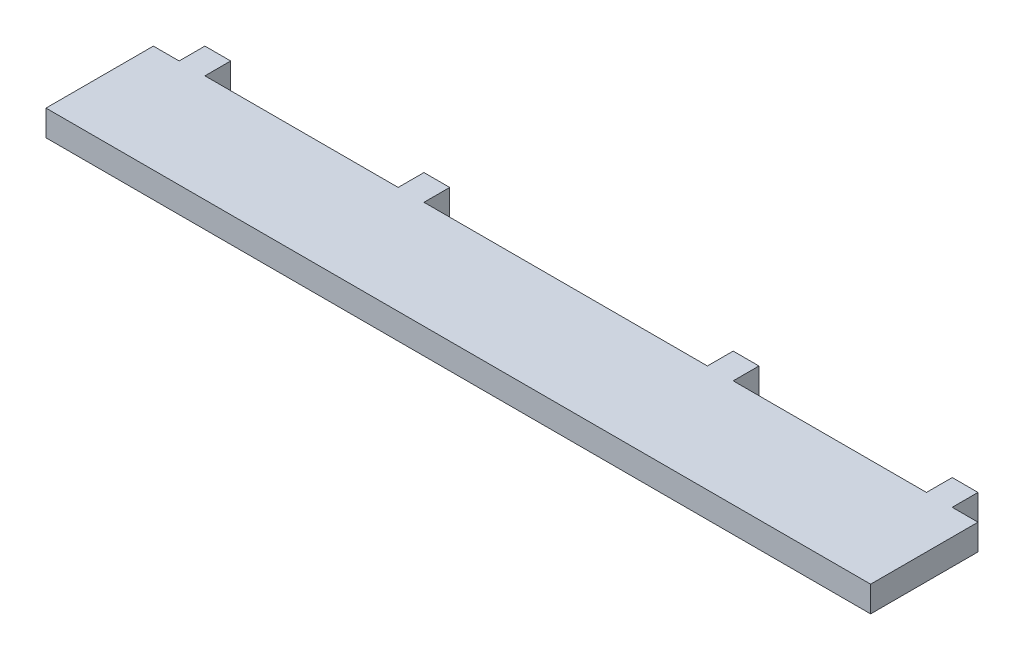
ISO-10303-21;
HEADER;
FILE_DESCRIPTION(('STEP AP214'),'2;1');
FILE_NAME('part.step','',(''),(''),'','','');
FILE_SCHEMA(('AUTOMOTIVE_DESIGN { 1 0 10303 214 1 1 1 1 }'));
ENDSEC;
DATA;
#1=APPLICATION_CONTEXT('core data for automotive mechanical design processes');
#2=APPLICATION_PROTOCOL_DEFINITION('international standard','automotive_design',2000,#1);
#3=PRODUCT_CONTEXT('',#1,'mechanical');
#4=PRODUCT('Part','Part','',(#3));
#5=PRODUCT_RELATED_PRODUCT_CATEGORY('part','',(#4));
#6=PRODUCT_DEFINITION_FORMATION('','',#4);
#7=PRODUCT_DEFINITION_CONTEXT('part definition',#1,'design');
#8=PRODUCT_DEFINITION('design','',#6,#7);
#9=PRODUCT_DEFINITION_SHAPE('','',#8);
#10=(LENGTH_UNIT() NAMED_UNIT(*) SI_UNIT(.MILLI.,.METRE.));
#11=(NAMED_UNIT(*) PLANE_ANGLE_UNIT() SI_UNIT($,.RADIAN.));
#12=(NAMED_UNIT(*) SI_UNIT($,.STERADIAN.) SOLID_ANGLE_UNIT());
#13=UNCERTAINTY_MEASURE_WITH_UNIT(LENGTH_MEASURE(1.E-05),#10,'distance_accuracy_value','');
#14=(GEOMETRIC_REPRESENTATION_CONTEXT(3) GLOBAL_UNCERTAINTY_ASSIGNED_CONTEXT((#13)) GLOBAL_UNIT_ASSIGNED_CONTEXT((#10,
#11,#12)) REPRESENTATION_CONTEXT('',''));
#15=CARTESIAN_POINT('',(0.,0.,0.));
#16=DIRECTION('',(0.,0.,1.));
#17=DIRECTION('',(1.,0.,0.));
#18=AXIS2_PLACEMENT_3D('',#15,#16,#17);
#19=CARTESIAN_POINT('',(0.,0.,0.));
#20=DIRECTION('',(0.,0.,-1.));
#21=DIRECTION('',(-1.,0.,0.));
#22=AXIS2_PLACEMENT_3D('',#19,#20,#21);
#23=PLANE('',#22);
#24=DIRECTION('',(-1.,0.,0.));
#25=VECTOR('',#24,1.);
#26=CARTESIAN_POINT('',(-96.,5.99999999999999,0.));
#27=LINE('',#26,#25);
#28=CARTESIAN_POINT('',(84.,6.,0.));
#29=VERTEX_POINT('',#28);
#30=CARTESIAN_POINT('',(39.,6.,0.));
#31=VERTEX_POINT('',#30);
#32=EDGE_CURVE('E177',#29,#31,#27,.T.);
#33=ORIENTED_EDGE('',*,*,#32,.F.);
#34=DIRECTION('',(0.,-1.,0.));
#35=VECTOR('',#34,1.);
#36=CARTESIAN_POINT('',(84.,6.,0.));
#37=LINE('',#36,#35);
#38=CARTESIAN_POINT('',(84.,0.,0.));
#39=VERTEX_POINT('',#38);
#40=EDGE_CURVE('E188',#29,#39,#37,.T.);
#41=ORIENTED_EDGE('',*,*,#40,.T.);
#42=DIRECTION('',(1.,0.,0.));
#43=VECTOR('',#42,1.);
#44=CARTESIAN_POINT('',(96.,0.,0.));
#45=LINE('',#44,#43);
#46=CARTESIAN_POINT('',(39.,0.,0.));
#47=VERTEX_POINT('',#46);
#48=EDGE_CURVE('E331',#47,#39,#45,.T.);
#49=ORIENTED_EDGE('',*,*,#48,.F.);
#50=DIRECTION('',(0.,-1.,0.));
#51=VECTOR('',#50,1.);
#52=CARTESIAN_POINT('',(39.,6.,0.));
#53=LINE('',#52,#51);
#54=EDGE_CURVE('E198',#31,#47,#53,.T.);
#55=ORIENTED_EDGE('',*,*,#54,.F.);
#56=EDGE_LOOP('',(#33,#41,#49,#55));
#57=FACE_BOUND('',#56,.T.);
#58=ADVANCED_FACE('F36',(#57),#23,.T.);
#59=CARTESIAN_POINT('',(90.,0.,0.));
#60=VERTEX_POINT('',#59);
#61=CARTESIAN_POINT('',(96.,0.,0.));
#62=VERTEX_POINT('',#61);
#63=EDGE_CURVE('E210',#60,#62,#45,.T.);
#64=ORIENTED_EDGE('',*,*,#63,.F.);
#65=DIRECTION('',(0.,-1.,0.));
#66=VECTOR('',#65,1.);
#67=CARTESIAN_POINT('',(90.,6.,0.));
#68=LINE('',#67,#66);
#69=CARTESIAN_POINT('',(90.,6.,0.));
#70=VERTEX_POINT('',#69);
#71=EDGE_CURVE('E195',#70,#60,#68,.T.);
#72=ORIENTED_EDGE('',*,*,#71,.F.);
#73=CARTESIAN_POINT('',(96.,5.99999999999999,0.));
#74=VERTEX_POINT('',#73);
#75=EDGE_CURVE('E199',#74,#70,#27,.T.);
#76=ORIENTED_EDGE('',*,*,#75,.F.);
#77=DIRECTION('',(0.,1.,0.));
#78=VECTOR('',#77,1.);
#79=CARTESIAN_POINT('',(96.,0.,0.));
#80=LINE('',#79,#78);
#81=EDGE_CURVE('E207',#62,#74,#80,.T.);
#82=ORIENTED_EDGE('',*,*,#81,.F.);
#83=EDGE_LOOP('',(#64,#72,#76,#82));
#84=FACE_BOUND('',#83,.T.);
#85=ADVANCED_FACE('F340',(#84),#23,.T.);
#86=CARTESIAN_POINT('',(33.,6.,0.));
#87=VERTEX_POINT('',#86);
#88=CARTESIAN_POINT('',(-33.,6.,0.));
#89=VERTEX_POINT('',#88);
#90=EDGE_CURVE('E200',#87,#89,#27,.T.);
#91=ORIENTED_EDGE('',*,*,#90,.F.);
#92=DIRECTION('',(0.,-1.,0.));
#93=VECTOR('',#92,1.);
#94=CARTESIAN_POINT('',(33.,6.,0.));
#95=LINE('',#94,#93);
#96=CARTESIAN_POINT('',(33.,0.,0.));
#97=VERTEX_POINT('',#96);
#98=EDGE_CURVE('E291',#87,#97,#95,.T.);
#99=ORIENTED_EDGE('',*,*,#98,.T.);
#100=CARTESIAN_POINT('',(-33.,0.,0.));
#101=VERTEX_POINT('',#100);
#102=EDGE_CURVE('E332',#101,#97,#45,.T.);
#103=ORIENTED_EDGE('',*,*,#102,.F.);
#104=DIRECTION('',(0.,-1.,0.));
#105=VECTOR('',#104,1.);
#106=CARTESIAN_POINT('',(-33.,6.,0.));
#107=LINE('',#106,#105);
#108=EDGE_CURVE('E268',#89,#101,#107,.T.);
#109=ORIENTED_EDGE('',*,*,#108,.F.);
#110=EDGE_LOOP('',(#91,#99,#103,#109));
#111=FACE_BOUND('',#110,.T.);
#112=ADVANCED_FACE('F375',(#111),#23,.T.);
#113=CARTESIAN_POINT('',(-39.,6.,0.));
#114=VERTEX_POINT('',#113);
#115=CARTESIAN_POINT('',(-84.,6.,0.));
#116=VERTEX_POINT('',#115);
#117=EDGE_CURVE('E204',#114,#116,#27,.T.);
#118=ORIENTED_EDGE('',*,*,#117,.F.);
#119=DIRECTION('',(0.,-1.,0.));
#120=VECTOR('',#119,1.);
#121=CARTESIAN_POINT('',(-39.,6.,0.));
#122=LINE('',#121,#120);
#123=CARTESIAN_POINT('',(-39.,0.,0.));
#124=VERTEX_POINT('',#123);
#125=EDGE_CURVE('E280',#114,#124,#122,.T.);
#126=ORIENTED_EDGE('',*,*,#125,.T.);
#127=CARTESIAN_POINT('',(-84.,0.,0.));
#128=VERTEX_POINT('',#127);
#129=EDGE_CURVE('E215',#128,#124,#45,.T.);
#130=ORIENTED_EDGE('',*,*,#129,.F.);
#131=DIRECTION('',(0.,-1.,0.));
#132=VECTOR('',#131,1.);
#133=CARTESIAN_POINT('',(-84.,6.,0.));
#134=LINE('',#133,#132);
#135=EDGE_CURVE('E251',#116,#128,#134,.T.);
#136=ORIENTED_EDGE('',*,*,#135,.F.);
#137=EDGE_LOOP('',(#118,#126,#130,#136));
#138=FACE_BOUND('',#137,.T.);
#139=ADVANCED_FACE('F352',(#138),#23,.T.);
#140=CARTESIAN_POINT('',(-90.,6.,0.));
#141=VERTEX_POINT('',#140);
#142=CARTESIAN_POINT('',(-96.,5.99999999999999,0.));
#143=VERTEX_POINT('',#142);
#144=EDGE_CURVE('E203',#141,#143,#27,.T.);
#145=ORIENTED_EDGE('',*,*,#144,.F.);
#146=DIRECTION('',(0.,-1.,0.));
#147=VECTOR('',#146,1.);
#148=CARTESIAN_POINT('',(-90.,6.,0.));
#149=LINE('',#148,#147);
#150=CARTESIAN_POINT('',(-90.,0.,0.));
#151=VERTEX_POINT('',#150);
#152=EDGE_CURVE('E236',#141,#151,#149,.T.);
#153=ORIENTED_EDGE('',*,*,#152,.T.);
#154=CARTESIAN_POINT('',(-96.,0.,0.));
#155=VERTEX_POINT('',#154);
#156=EDGE_CURVE('E211',#155,#151,#45,.T.);
#157=ORIENTED_EDGE('',*,*,#156,.F.);
#158=DIRECTION('',(0.,-1.,0.));
#159=VECTOR('',#158,1.);
#160=CARTESIAN_POINT('',(-96.,0.,0.));
#161=LINE('',#160,#159);
#162=EDGE_CURVE('E202',#143,#155,#161,.T.);
#163=ORIENTED_EDGE('',*,*,#162,.F.);
#164=EDGE_LOOP('',(#145,#153,#157,#163));
#165=FACE_BOUND('',#164,.T.);
#166=ADVANCED_FACE('F233',(#165),#23,.T.);
#167=CARTESIAN_POINT('',(96.,0.,25.));
#168=DIRECTION('',(-1.,0.,0.));
#169=DIRECTION('',(0.,0.,1.));
#170=AXIS2_PLACEMENT_3D('',#167,#168,#169);
#171=PLANE('',#170);
#172=ORIENTED_EDGE('',*,*,#81,.T.);
#173=DIRECTION('',(0.,0.,-1.));
#174=VECTOR('',#173,1.);
#175=CARTESIAN_POINT('',(96.,5.99999999999999,25.));
#176=LINE('',#175,#174);
#177=CARTESIAN_POINT('',(96.,5.99999999999999,25.));
#178=VERTEX_POINT('',#177);
#179=EDGE_CURVE('E11',#178,#74,#176,.T.);
#180=ORIENTED_EDGE('',*,*,#179,.F.);
#181=DIRECTION('',(0.,1.,0.));
#182=VECTOR('',#181,1.);
#183=CARTESIAN_POINT('',(96.,0.,25.));
#184=LINE('',#183,#182);
#185=CARTESIAN_POINT('',(96.,0.,25.));
#186=VERTEX_POINT('',#185);
#187=EDGE_CURVE('E214',#186,#178,#184,.T.);
#188=ORIENTED_EDGE('',*,*,#187,.F.);
#189=DIRECTION('',(0.,0.,-1.));
#190=VECTOR('',#189,1.);
#191=CARTESIAN_POINT('',(96.,0.,25.));
#192=LINE('',#191,#190);
#193=EDGE_CURVE('E216',#186,#62,#192,.T.);
#194=ORIENTED_EDGE('',*,*,#193,.T.);
#195=EDGE_LOOP('',(#172,#180,#188,#194));
#196=FACE_BOUND('',#195,.T.);
#197=ADVANCED_FACE('F38',(#196),#171,.F.);
#198=CARTESIAN_POINT('',(-96.,5.99999999999999,25.));
#199=DIRECTION('',(0.,-1.,0.));
#200=DIRECTION('',(0.,0.,-1.));
#201=AXIS2_PLACEMENT_3D('',#198,#199,#200);
#202=PLANE('',#201);
#203=ORIENTED_EDGE('',*,*,#75,.T.);
#204=DIRECTION('',(0.,0.,-1.));
#205=VECTOR('',#204,1.);
#206=CARTESIAN_POINT('',(90.,6.,0.));
#207=LINE('',#206,#205);
#208=CARTESIAN_POINT('',(90.,6.,-6.));
#209=VERTEX_POINT('',#208);
#210=EDGE_CURVE('E184',#70,#209,#207,.T.);
#211=ORIENTED_EDGE('',*,*,#210,.T.);
#212=DIRECTION('',(-1.,0.,0.));
#213=VECTOR('',#212,1.);
#214=CARTESIAN_POINT('',(90.,6.,-6.));
#215=LINE('',#214,#213);
#216=CARTESIAN_POINT('',(84.,6.,-6.));
#217=VERTEX_POINT('',#216);
#218=EDGE_CURVE('E180',#209,#217,#215,.T.);
#219=ORIENTED_EDGE('',*,*,#218,.T.);
#220=DIRECTION('',(0.,0.,1.));
#221=VECTOR('',#220,1.);
#222=CARTESIAN_POINT('',(84.,6.,-6.));
#223=LINE('',#222,#221);
#224=EDGE_CURVE('E172',#217,#29,#223,.T.);
#225=ORIENTED_EDGE('',*,*,#224,.T.);
#226=ORIENTED_EDGE('',*,*,#32,.T.);
#227=DIRECTION('',(0.,0.,-1.));
#228=VECTOR('',#227,1.);
#229=CARTESIAN_POINT('',(39.,6.,0.));
#230=LINE('',#229,#228);
#231=CARTESIAN_POINT('',(39.,6.,-6.));
#232=VERTEX_POINT('',#231);
#233=EDGE_CURVE('E312',#31,#232,#230,.T.);
#234=ORIENTED_EDGE('',*,*,#233,.T.);
#235=DIRECTION('',(-1.,0.,0.));
#236=VECTOR('',#235,1.);
#237=CARTESIAN_POINT('',(39.,6.,-6.));
#238=LINE('',#237,#236);
#239=CARTESIAN_POINT('',(33.,6.,-6.));
#240=VERTEX_POINT('',#239);
#241=EDGE_CURVE('E305',#232,#240,#238,.T.);
#242=ORIENTED_EDGE('',*,*,#241,.T.);
#243=DIRECTION('',(0.,0.,1.));
#244=VECTOR('',#243,1.);
#245=CARTESIAN_POINT('',(33.,6.,-6.));
#246=LINE('',#245,#244);
#247=EDGE_CURVE('E308',#240,#87,#246,.T.);
#248=ORIENTED_EDGE('',*,*,#247,.T.);
#249=ORIENTED_EDGE('',*,*,#90,.T.);
#250=DIRECTION('',(0.,0.,-1.));
#251=VECTOR('',#250,1.);
#252=CARTESIAN_POINT('',(-33.,6.,-6.));
#253=LINE('',#252,#251);
#254=CARTESIAN_POINT('',(-33.,6.,-6.));
#255=VERTEX_POINT('',#254);
#256=EDGE_CURVE('E286',#89,#255,#253,.T.);
#257=ORIENTED_EDGE('',*,*,#256,.T.);
#258=DIRECTION('',(-1.,0.,0.));
#259=VECTOR('',#258,1.);
#260=CARTESIAN_POINT('',(-39.,6.,-6.));
#261=LINE('',#260,#259);
#262=CARTESIAN_POINT('',(-39.,6.,-6.));
#263=VERTEX_POINT('',#262);
#264=EDGE_CURVE('E293',#255,#263,#261,.T.);
#265=ORIENTED_EDGE('',*,*,#264,.T.);
#266=DIRECTION('',(0.,0.,1.));
#267=VECTOR('',#266,1.);
#268=CARTESIAN_POINT('',(-39.,6.,0.));
#269=LINE('',#268,#267);
#270=EDGE_CURVE('E283',#263,#114,#269,.T.);
#271=ORIENTED_EDGE('',*,*,#270,.T.);
#272=ORIENTED_EDGE('',*,*,#117,.T.);
#273=DIRECTION('',(0.,0.,-1.));
#274=VECTOR('',#273,1.);
#275=CARTESIAN_POINT('',(-84.,6.,-6.));
#276=LINE('',#275,#274);
#277=CARTESIAN_POINT('',(-84.,6.,-6.));
#278=VERTEX_POINT('',#277);
#279=EDGE_CURVE('E263',#116,#278,#276,.T.);
#280=ORIENTED_EDGE('',*,*,#279,.T.);
#281=DIRECTION('',(-1.,0.,0.));
#282=VECTOR('',#281,1.);
#283=CARTESIAN_POINT('',(-90.,6.,-6.));
#284=LINE('',#283,#282);
#285=CARTESIAN_POINT('',(-90.,6.,-6.));
#286=VERTEX_POINT('',#285);
#287=EDGE_CURVE('E270',#278,#286,#284,.T.);
#288=ORIENTED_EDGE('',*,*,#287,.T.);
#289=DIRECTION('',(0.,0.,1.));
#290=VECTOR('',#289,1.);
#291=CARTESIAN_POINT('',(-90.,6.,0.));
#292=LINE('',#291,#290);
#293=EDGE_CURVE('E261',#286,#141,#292,.T.);
#294=ORIENTED_EDGE('',*,*,#293,.T.);
#295=ORIENTED_EDGE('',*,*,#144,.T.);
#296=DIRECTION('',(0.,0.,-1.));
#297=VECTOR('',#296,1.);
#298=CARTESIAN_POINT('',(-96.,5.99999999999999,25.));
#299=LINE('',#298,#297);
#300=CARTESIAN_POINT('',(-96.,5.99999999999999,25.));
#301=VERTEX_POINT('',#300);
#302=EDGE_CURVE('E44',#301,#143,#299,.T.);
#303=ORIENTED_EDGE('',*,*,#302,.F.);
#304=DIRECTION('',(-1.,0.,0.));
#305=VECTOR('',#304,1.);
#306=CARTESIAN_POINT('',(-96.,5.99999999999999,25.));
#307=LINE('',#306,#305);
#308=EDGE_CURVE('E246',#178,#301,#307,.T.);
#309=ORIENTED_EDGE('',*,*,#308,.F.);
#310=ORIENTED_EDGE('',*,*,#179,.T.);
#311=EDGE_LOOP('',(#203,#211,#219,#225,#226,#234,#242,#248,#249,#257,#265,#271,#272,#280,#288,
#294,#295,#303,#309,#310));
#312=FACE_BOUND('',#311,.T.);
#313=ADVANCED_FACE('F175',(#312),#202,.F.);
#314=CARTESIAN_POINT('',(-96.,0.,25.));
#315=DIRECTION('',(1.,0.,0.));
#316=DIRECTION('',(0.,0.,-1.));
#317=AXIS2_PLACEMENT_3D('',#314,#315,#316);
#318=PLANE('',#317);
#319=ORIENTED_EDGE('',*,*,#162,.T.);
#320=DIRECTION('',(0.,0.,-1.));
#321=VECTOR('',#320,1.);
#322=CARTESIAN_POINT('',(-96.,0.,25.));
#323=LINE('',#322,#321);
#324=CARTESIAN_POINT('',(-96.,0.,25.));
#325=VERTEX_POINT('',#324);
#326=EDGE_CURVE('E219',#325,#155,#323,.T.);
#327=ORIENTED_EDGE('',*,*,#326,.F.);
#328=DIRECTION('',(0.,-1.,0.));
#329=VECTOR('',#328,1.);
#330=CARTESIAN_POINT('',(-96.,0.,25.));
#331=LINE('',#330,#329);
#332=EDGE_CURVE('E229',#301,#325,#331,.T.);
#333=ORIENTED_EDGE('',*,*,#332,.F.);
#334=ORIENTED_EDGE('',*,*,#302,.T.);
#335=EDGE_LOOP('',(#319,#327,#333,#334));
#336=FACE_BOUND('',#335,.T.);
#337=ADVANCED_FACE('F227',(#336),#318,.F.);
#338=CARTESIAN_POINT('',(96.,0.,25.));
#339=DIRECTION('',(0.,1.,0.));
#340=DIRECTION('',(0.,0.,1.));
#341=AXIS2_PLACEMENT_3D('',#338,#339,#340);
#342=PLANE('',#341);
#343=ORIENTED_EDGE('',*,*,#156,.T.);
#344=DIRECTION('',(0.,0.,1.));
#345=VECTOR('',#344,1.);
#346=CARTESIAN_POINT('',(-90.,0.,0.));
#347=LINE('',#346,#345);
#348=CARTESIAN_POINT('',(-90.,0.,-6.));
#349=VERTEX_POINT('',#348);
#350=EDGE_CURVE('E240',#349,#151,#347,.T.);
#351=ORIENTED_EDGE('',*,*,#350,.F.);
#352=DIRECTION('',(-1.,0.,0.));
#353=VECTOR('',#352,1.);
#354=CARTESIAN_POINT('',(-90.,0.,-6.));
#355=LINE('',#354,#353);
#356=CARTESIAN_POINT('',(-84.,0.,-6.));
#357=VERTEX_POINT('',#356);
#358=EDGE_CURVE('E264',#357,#349,#355,.T.);
#359=ORIENTED_EDGE('',*,*,#358,.F.);
#360=DIRECTION('',(0.,0.,-1.));
#361=VECTOR('',#360,1.);
#362=CARTESIAN_POINT('',(-84.,0.,-6.));
#363=LINE('',#362,#361);
#364=EDGE_CURVE('E266',#128,#357,#363,.T.);
#365=ORIENTED_EDGE('',*,*,#364,.F.);
#366=ORIENTED_EDGE('',*,*,#129,.T.);
#367=DIRECTION('',(0.,0.,1.));
#368=VECTOR('',#367,1.);
#369=CARTESIAN_POINT('',(-39.,0.,0.));
#370=LINE('',#369,#368);
#371=CARTESIAN_POINT('',(-39.,0.,-6.));
#372=VERTEX_POINT('',#371);
#373=EDGE_CURVE('E284',#372,#124,#370,.T.);
#374=ORIENTED_EDGE('',*,*,#373,.F.);
#375=DIRECTION('',(-1.,0.,0.));
#376=VECTOR('',#375,1.);
#377=CARTESIAN_POINT('',(-39.,0.,-6.));
#378=LINE('',#377,#376);
#379=CARTESIAN_POINT('',(-33.,0.,-6.));
#380=VERTEX_POINT('',#379);
#381=EDGE_CURVE('E287',#380,#372,#378,.T.);
#382=ORIENTED_EDGE('',*,*,#381,.F.);
#383=DIRECTION('',(0.,0.,-1.));
#384=VECTOR('',#383,1.);
#385=CARTESIAN_POINT('',(-33.,0.,-6.));
#386=LINE('',#385,#384);
#387=EDGE_CURVE('E289',#101,#380,#386,.T.);
#388=ORIENTED_EDGE('',*,*,#387,.F.);
#389=ORIENTED_EDGE('',*,*,#102,.T.);
#390=DIRECTION('',(0.,0.,1.));
#391=VECTOR('',#390,1.);
#392=CARTESIAN_POINT('',(33.,0.,-6.));
#393=LINE('',#392,#391);
#394=CARTESIAN_POINT('',(33.,0.,-6.));
#395=VERTEX_POINT('',#394);
#396=EDGE_CURVE('E194',#395,#97,#393,.T.);
#397=ORIENTED_EDGE('',*,*,#396,.F.);
#398=DIRECTION('',(-1.,0.,0.));
#399=VECTOR('',#398,1.);
#400=CARTESIAN_POINT('',(39.,0.,-6.));
#401=LINE('',#400,#399);
#402=CARTESIAN_POINT('',(39.,0.,-6.));
#403=VERTEX_POINT('',#402);
#404=EDGE_CURVE('E306',#403,#395,#401,.T.);
#405=ORIENTED_EDGE('',*,*,#404,.F.);
#406=DIRECTION('',(0.,0.,-1.));
#407=VECTOR('',#406,1.);
#408=CARTESIAN_POINT('',(39.,0.,0.));
#409=LINE('',#408,#407);
#410=EDGE_CURVE('E58',#47,#403,#409,.T.);
#411=ORIENTED_EDGE('',*,*,#410,.F.);
#412=ORIENTED_EDGE('',*,*,#48,.T.);
#413=DIRECTION('',(0.,0.,1.));
#414=VECTOR('',#413,1.);
#415=CARTESIAN_POINT('',(84.,0.,-6.));
#416=LINE('',#415,#414);
#417=CARTESIAN_POINT('',(84.,0.,-6.));
#418=VERTEX_POINT('',#417);
#419=EDGE_CURVE('E191',#418,#39,#416,.T.);
#420=ORIENTED_EDGE('',*,*,#419,.F.);
#421=DIRECTION('',(-1.,0.,0.));
#422=VECTOR('',#421,1.);
#423=CARTESIAN_POINT('',(90.,0.,-6.));
#424=LINE('',#423,#422);
#425=CARTESIAN_POINT('',(90.,0.,-6.));
#426=VERTEX_POINT('',#425);
#427=EDGE_CURVE('E185',#426,#418,#424,.T.);
#428=ORIENTED_EDGE('',*,*,#427,.F.);
#429=DIRECTION('',(0.,0.,-1.));
#430=VECTOR('',#429,1.);
#431=CARTESIAN_POINT('',(90.,0.,0.));
#432=LINE('',#431,#430);
#433=EDGE_CURVE('E51',#60,#426,#432,.T.);
#434=ORIENTED_EDGE('',*,*,#433,.F.);
#435=ORIENTED_EDGE('',*,*,#63,.T.);
#436=ORIENTED_EDGE('',*,*,#193,.F.);
#437=DIRECTION('',(1.,0.,0.));
#438=VECTOR('',#437,1.);
#439=CARTESIAN_POINT('',(96.,0.,25.));
#440=LINE('',#439,#438);
#441=EDGE_CURVE('E220',#325,#186,#440,.T.);
#442=ORIENTED_EDGE('',*,*,#441,.F.);
#443=ORIENTED_EDGE('',*,*,#326,.T.);
#444=EDGE_LOOP('',(#343,#351,#359,#365,#366,#374,#382,#388,#389,#397,#405,#411,#412,#420,#428,
#434,#435,#436,#442,#443));
#445=FACE_BOUND('',#444,.T.);
#446=ADVANCED_FACE('F238',(#445),#342,.F.);
#447=CARTESIAN_POINT('',(0.,0.,25.));
#448=DIRECTION('',(0.,0.,-1.));
#449=DIRECTION('',(-1.,0.,0.));
#450=AXIS2_PLACEMENT_3D('',#447,#448,#449);
#451=PLANE('',#450);
#452=ORIENTED_EDGE('',*,*,#187,.T.);
#453=ORIENTED_EDGE('',*,*,#308,.T.);
#454=ORIENTED_EDGE('',*,*,#332,.T.);
#455=ORIENTED_EDGE('',*,*,#441,.T.);
#456=EDGE_LOOP('',(#452,#453,#454,#455));
#457=FACE_BOUND('',#456,.T.);
#458=ADVANCED_FACE('F399',(#457),#451,.F.);
#459=CARTESIAN_POINT('',(-84.,6.,-6.));
#460=DIRECTION('',(-1.,0.,0.));
#461=DIRECTION('',(0.,0.,1.));
#462=AXIS2_PLACEMENT_3D('',#459,#460,#461);
#463=PLANE('',#462);
#464=ORIENTED_EDGE('',*,*,#364,.T.);
#465=DIRECTION('',(0.,-1.,0.));
#466=VECTOR('',#465,1.);
#467=CARTESIAN_POINT('',(-84.,6.,-6.));
#468=LINE('',#467,#466);
#469=EDGE_CURVE('E254',#278,#357,#468,.T.);
#470=ORIENTED_EDGE('',*,*,#469,.F.);
#471=ORIENTED_EDGE('',*,*,#279,.F.);
#472=ORIENTED_EDGE('',*,*,#135,.T.);
#473=EDGE_LOOP('',(#464,#470,#471,#472));
#474=FACE_BOUND('',#473,.T.);
#475=ADVANCED_FACE('F349',(#474),#463,.F.);
#476=CARTESIAN_POINT('',(-90.,6.,-6.));
#477=DIRECTION('',(0.,0.,1.));
#478=DIRECTION('',(1.,0.,0.));
#479=AXIS2_PLACEMENT_3D('',#476,#477,#478);
#480=PLANE('',#479);
#481=ORIENTED_EDGE('',*,*,#358,.T.);
#482=DIRECTION('',(0.,-1.,0.));
#483=VECTOR('',#482,1.);
#484=CARTESIAN_POINT('',(-90.,6.,-6.));
#485=LINE('',#484,#483);
#486=EDGE_CURVE('E257',#286,#349,#485,.T.);
#487=ORIENTED_EDGE('',*,*,#486,.F.);
#488=ORIENTED_EDGE('',*,*,#287,.F.);
#489=ORIENTED_EDGE('',*,*,#469,.T.);
#490=EDGE_LOOP('',(#481,#487,#488,#489));
#491=FACE_BOUND('',#490,.T.);
#492=ADVANCED_FACE('F357',(#491),#480,.F.);
#493=CARTESIAN_POINT('',(-90.,6.,0.));
#494=DIRECTION('',(1.,0.,0.));
#495=DIRECTION('',(0.,0.,-1.));
#496=AXIS2_PLACEMENT_3D('',#493,#494,#495);
#497=PLANE('',#496);
#498=ORIENTED_EDGE('',*,*,#350,.T.);
#499=ORIENTED_EDGE('',*,*,#152,.F.);
#500=ORIENTED_EDGE('',*,*,#293,.F.);
#501=ORIENTED_EDGE('',*,*,#486,.T.);
#502=EDGE_LOOP('',(#498,#499,#500,#501));
#503=FACE_BOUND('',#502,.T.);
#504=ADVANCED_FACE('F361',(#503),#497,.F.);
#505=CARTESIAN_POINT('',(-33.,6.,-6.));
#506=DIRECTION('',(-1.,0.,0.));
#507=DIRECTION('',(0.,0.,1.));
#508=AXIS2_PLACEMENT_3D('',#505,#506,#507);
#509=PLANE('',#508);
#510=ORIENTED_EDGE('',*,*,#387,.T.);
#511=DIRECTION('',(0.,-1.,0.));
#512=VECTOR('',#511,1.);
#513=CARTESIAN_POINT('',(-33.,6.,-6.));
#514=LINE('',#513,#512);
#515=EDGE_CURVE('E274',#255,#380,#514,.T.);
#516=ORIENTED_EDGE('',*,*,#515,.F.);
#517=ORIENTED_EDGE('',*,*,#256,.F.);
#518=ORIENTED_EDGE('',*,*,#108,.T.);
#519=EDGE_LOOP('',(#510,#516,#517,#518));
#520=FACE_BOUND('',#519,.T.);
#521=ADVANCED_FACE('F363',(#520),#509,.F.);
#522=CARTESIAN_POINT('',(-39.,6.,-6.));
#523=DIRECTION('',(0.,0.,1.));
#524=DIRECTION('',(1.,0.,0.));
#525=AXIS2_PLACEMENT_3D('',#522,#523,#524);
#526=PLANE('',#525);
#527=ORIENTED_EDGE('',*,*,#381,.T.);
#528=DIRECTION('',(0.,-1.,0.));
#529=VECTOR('',#528,1.);
#530=CARTESIAN_POINT('',(-39.,6.,-6.));
#531=LINE('',#530,#529);
#532=EDGE_CURVE('E277',#263,#372,#531,.T.);
#533=ORIENTED_EDGE('',*,*,#532,.F.);
#534=ORIENTED_EDGE('',*,*,#264,.F.);
#535=ORIENTED_EDGE('',*,*,#515,.T.);
#536=EDGE_LOOP('',(#527,#533,#534,#535));
#537=FACE_BOUND('',#536,.T.);
#538=ADVANCED_FACE('F369',(#537),#526,.F.);
#539=CARTESIAN_POINT('',(-39.,6.,0.));
#540=DIRECTION('',(1.,0.,0.));
#541=DIRECTION('',(0.,0.,-1.));
#542=AXIS2_PLACEMENT_3D('',#539,#540,#541);
#543=PLANE('',#542);
#544=ORIENTED_EDGE('',*,*,#373,.T.);
#545=ORIENTED_EDGE('',*,*,#125,.F.);
#546=ORIENTED_EDGE('',*,*,#270,.F.);
#547=ORIENTED_EDGE('',*,*,#532,.T.);
#548=EDGE_LOOP('',(#544,#545,#546,#547));
#549=FACE_BOUND('',#548,.T.);
#550=ADVANCED_FACE('F432',(#549),#543,.F.);
#551=CARTESIAN_POINT('',(33.,6.,-6.));
#552=DIRECTION('',(1.,0.,0.));
#553=DIRECTION('',(0.,0.,-1.));
#554=AXIS2_PLACEMENT_3D('',#551,#552,#553);
#555=PLANE('',#554);
#556=ORIENTED_EDGE('',*,*,#396,.T.);
#557=ORIENTED_EDGE('',*,*,#98,.F.);
#558=ORIENTED_EDGE('',*,*,#247,.F.);
#559=DIRECTION('',(0.,-1.,0.));
#560=VECTOR('',#559,1.);
#561=CARTESIAN_POINT('',(33.,6.,-6.));
#562=LINE('',#561,#560);
#563=EDGE_CURVE('E302',#240,#395,#562,.T.);
#564=ORIENTED_EDGE('',*,*,#563,.T.);
#565=EDGE_LOOP('',(#556,#557,#558,#564));
#566=FACE_BOUND('',#565,.T.);
#567=ADVANCED_FACE('F442',(#566),#555,.F.);
#568=CARTESIAN_POINT('',(39.,6.,0.));
#569=DIRECTION('',(-1.,0.,0.));
#570=DIRECTION('',(0.,0.,1.));
#571=AXIS2_PLACEMENT_3D('',#568,#569,#570);
#572=PLANE('',#571);
#573=ORIENTED_EDGE('',*,*,#410,.T.);
#574=DIRECTION('',(0.,-1.,0.));
#575=VECTOR('',#574,1.);
#576=CARTESIAN_POINT('',(39.,6.,-6.));
#577=LINE('',#576,#575);
#578=EDGE_CURVE('E299',#232,#403,#577,.T.);
#579=ORIENTED_EDGE('',*,*,#578,.F.);
#580=ORIENTED_EDGE('',*,*,#233,.F.);
#581=ORIENTED_EDGE('',*,*,#54,.T.);
#582=EDGE_LOOP('',(#573,#579,#580,#581));
#583=FACE_BOUND('',#582,.T.);
#584=ADVANCED_FACE('F452',(#583),#572,.F.);
#585=CARTESIAN_POINT('',(39.,6.,-6.));
#586=DIRECTION('',(0.,0.,1.));
#587=DIRECTION('',(1.,0.,0.));
#588=AXIS2_PLACEMENT_3D('',#585,#586,#587);
#589=PLANE('',#588);
#590=ORIENTED_EDGE('',*,*,#404,.T.);
#591=ORIENTED_EDGE('',*,*,#563,.F.);
#592=ORIENTED_EDGE('',*,*,#241,.F.);
#593=ORIENTED_EDGE('',*,*,#578,.T.);
#594=EDGE_LOOP('',(#590,#591,#592,#593));
#595=FACE_BOUND('',#594,.T.);
#596=ADVANCED_FACE('F462',(#595),#589,.F.);
#597=CARTESIAN_POINT('',(84.,6.,-6.));
#598=DIRECTION('',(1.,0.,0.));
#599=DIRECTION('',(0.,0.,-1.));
#600=AXIS2_PLACEMENT_3D('',#597,#598,#599);
#601=PLANE('',#600);
#602=ORIENTED_EDGE('',*,*,#419,.T.);
#603=ORIENTED_EDGE('',*,*,#40,.F.);
#604=ORIENTED_EDGE('',*,*,#224,.F.);
#605=DIRECTION('',(0.,-1.,0.));
#606=VECTOR('',#605,1.);
#607=CARTESIAN_POINT('',(84.,6.,-6.));
#608=LINE('',#607,#606);
#609=EDGE_CURVE('E319',#217,#418,#608,.T.);
#610=ORIENTED_EDGE('',*,*,#609,.T.);
#611=EDGE_LOOP('',(#602,#603,#604,#610));
#612=FACE_BOUND('',#611,.T.);
#613=ADVANCED_FACE('F189',(#612),#601,.F.);
#614=CARTESIAN_POINT('',(90.,6.,0.));
#615=DIRECTION('',(-1.,0.,0.));
#616=DIRECTION('',(0.,0.,1.));
#617=AXIS2_PLACEMENT_3D('',#614,#615,#616);
#618=PLANE('',#617);
#619=ORIENTED_EDGE('',*,*,#433,.T.);
#620=DIRECTION('',(0.,-1.,0.));
#621=VECTOR('',#620,1.);
#622=CARTESIAN_POINT('',(90.,6.,-6.));
#623=LINE('',#622,#621);
#624=EDGE_CURVE('E316',#209,#426,#623,.T.);
#625=ORIENTED_EDGE('',*,*,#624,.F.);
#626=ORIENTED_EDGE('',*,*,#210,.F.);
#627=ORIENTED_EDGE('',*,*,#71,.T.);
#628=EDGE_LOOP('',(#619,#625,#626,#627));
#629=FACE_BOUND('',#628,.T.);
#630=ADVANCED_FACE('F328',(#629),#618,.F.);
#631=CARTESIAN_POINT('',(90.,6.,-6.));
#632=DIRECTION('',(0.,0.,1.));
#633=DIRECTION('',(1.,0.,0.));
#634=AXIS2_PLACEMENT_3D('',#631,#632,#633);
#635=PLANE('',#634);
#636=ORIENTED_EDGE('',*,*,#427,.T.);
#637=ORIENTED_EDGE('',*,*,#609,.F.);
#638=ORIENTED_EDGE('',*,*,#218,.F.);
#639=ORIENTED_EDGE('',*,*,#624,.T.);
#640=EDGE_LOOP('',(#636,#637,#638,#639));
#641=FACE_BOUND('',#640,.T.);
#642=ADVANCED_FACE('F330',(#641),#635,.F.);
#643=CLOSED_SHELL('',(#58,#85,#112,#139,#166,#197,#313,#337,#446,#458,#475,#492,#504,#521,#538,
#550,#567,#584,#596,#613,#630,#642));
#644=MANIFOLD_SOLID_BREP('B2',#643);
#645=ADVANCED_BREP_SHAPE_REPRESENTATION('',(#18,#644),#14);
#646=SHAPE_DEFINITION_REPRESENTATION(#9,#645);
ENDSEC;
END-ISO-10303-21;
